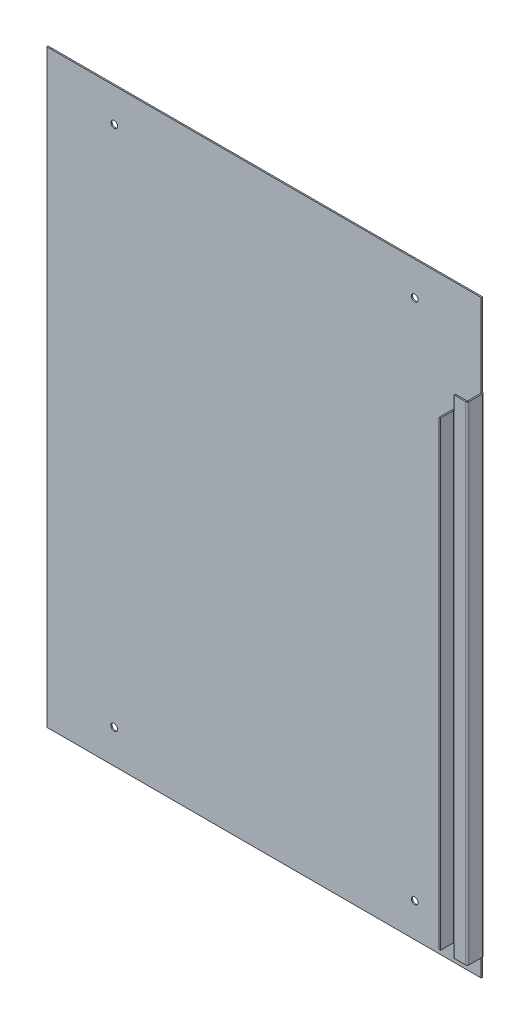
ISO-10303-21;
HEADER;
FILE_DESCRIPTION(('STEP AP214'),'2;1');
FILE_NAME('part.step','',(''),(''),'','','');
FILE_SCHEMA(('AUTOMOTIVE_DESIGN { 1 0 10303 214 1 1 1 1 }'));
ENDSEC;
DATA;
#1=APPLICATION_CONTEXT('core data for automotive mechanical design processes');
#2=APPLICATION_PROTOCOL_DEFINITION('international standard','automotive_design',2000,#1);
#3=PRODUCT_CONTEXT('',#1,'mechanical');
#4=PRODUCT('Part','Part','',(#3));
#5=PRODUCT_RELATED_PRODUCT_CATEGORY('part','',(#4));
#6=PRODUCT_DEFINITION_FORMATION('','',#4);
#7=PRODUCT_DEFINITION_CONTEXT('part definition',#1,'design');
#8=PRODUCT_DEFINITION('design','',#6,#7);
#9=PRODUCT_DEFINITION_SHAPE('','',#8);
#10=(LENGTH_UNIT() NAMED_UNIT(*) SI_UNIT(.MILLI.,.METRE.));
#11=(NAMED_UNIT(*) PLANE_ANGLE_UNIT() SI_UNIT($,.RADIAN.));
#12=(NAMED_UNIT(*) SI_UNIT($,.STERADIAN.) SOLID_ANGLE_UNIT());
#13=UNCERTAINTY_MEASURE_WITH_UNIT(LENGTH_MEASURE(1.E-05),#10,'distance_accuracy_value','');
#14=(GEOMETRIC_REPRESENTATION_CONTEXT(3) GLOBAL_UNCERTAINTY_ASSIGNED_CONTEXT((#13)) GLOBAL_UNIT_ASSIGNED_CONTEXT((#10,
#11,#12)) REPRESENTATION_CONTEXT('',''));
#15=CARTESIAN_POINT('',(0.,0.,0.));
#16=DIRECTION('',(0.,0.,1.));
#17=DIRECTION('',(1.,0.,0.));
#18=AXIS2_PLACEMENT_3D('',#15,#16,#17);
#19=CARTESIAN_POINT('',(302.15,876.2,25.));
#20=DIRECTION('',(1.,0.,0.));
#21=DIRECTION('',(0.,0.,-1.));
#22=AXIS2_PLACEMENT_3D('',#19,#20,#21);
#23=PLANE('',#22);
#24=DIRECTION('',(0.,0.,-1.));
#25=VECTOR('',#24,1.);
#26=CARTESIAN_POINT('',(302.15,733.7,22.3634));
#27=LINE('',#26,#25);
#28=CARTESIAN_POINT('',(302.15,733.7,45.));
#29=VERTEX_POINT('',#28);
#30=CARTESIAN_POINT('',(302.15,733.7,25.7366));
#31=VERTEX_POINT('',#30);
#32=EDGE_CURVE('E225',#29,#31,#27,.T.);
#33=ORIENTED_EDGE('',*,*,#32,.T.);
#34=DIRECTION('',(0.,-1.,0.));
#35=VECTOR('',#34,1.);
#36=CARTESIAN_POINT('',(302.15,876.2,25.7366));
#37=LINE('',#36,#35);
#38=CARTESIAN_POINT('',(302.15,48.4,25.7366));
#39=VERTEX_POINT('',#38);
#40=EDGE_CURVE('E248',#31,#39,#37,.T.);
#41=ORIENTED_EDGE('',*,*,#40,.T.);
#42=DIRECTION('',(0.,0.,1.));
#43=VECTOR('',#42,1.);
#44=CARTESIAN_POINT('',(302.15,48.4,35.3683));
#45=LINE('',#44,#43);
#46=CARTESIAN_POINT('',(302.15,48.4,45.));
#47=VERTEX_POINT('',#46);
#48=EDGE_CURVE('E231',#47,#39,#45,.F.);
#49=ORIENTED_EDGE('',*,*,#48,.F.);
#50=DIRECTION('',(0.,-1.,0.));
#51=VECTOR('',#50,1.);
#52=CARTESIAN_POINT('',(302.15,876.2,45.));
#53=LINE('',#52,#51);
#54=EDGE_CURVE('E250',#29,#47,#53,.T.);
#55=ORIENTED_EDGE('',*,*,#54,.F.);
#56=EDGE_LOOP('',(#33,#41,#49,#55));
#57=FACE_BOUND('',#56,.T.);
#58=ADVANCED_FACE('F69',(#57),#23,.F.);
#59=CARTESIAN_POINT('',(304.05,876.2,45.));
#60=DIRECTION('',(0.,0.,1.));
#61=DIRECTION('',(1.,0.,0.));
#62=AXIS2_PLACEMENT_3D('',#59,#60,#61);
#63=PLANE('',#62);
#64=DIRECTION('',(0.,-1.,0.));
#65=VECTOR('',#64,1.);
#66=CARTESIAN_POINT('',(304.05,876.2,45.));
#67=LINE('',#66,#65);
#68=CARTESIAN_POINT('',(304.05,733.7,45.));
#69=VERTEX_POINT('',#68);
#70=CARTESIAN_POINT('',(304.05,48.4,45.));
#71=VERTEX_POINT('',#70);
#72=EDGE_CURVE('E303',#69,#71,#67,.T.);
#73=ORIENTED_EDGE('',*,*,#72,.F.);
#74=DIRECTION('',(1.,0.,0.));
#75=VECTOR('',#74,1.);
#76=CARTESIAN_POINT('',(302.15,733.7,45.));
#77=LINE('',#76,#75);
#78=EDGE_CURVE('E251',#69,#29,#77,.F.);
#79=ORIENTED_EDGE('',*,*,#78,.T.);
#80=ORIENTED_EDGE('',*,*,#54,.T.);
#81=DIRECTION('',(-1.,0.,0.));
#82=VECTOR('',#81,1.);
#83=CARTESIAN_POINT('',(304.05,48.4,45.));
#84=LINE('',#83,#82);
#85=EDGE_CURVE('E329',#47,#71,#84,.F.);
#86=ORIENTED_EDGE('',*,*,#85,.T.);
#87=EDGE_LOOP('',(#73,#79,#80,#86));
#88=FACE_BOUND('',#87,.T.);
#89=ADVANCED_FACE('F562',(#88),#63,.T.);
#90=CARTESIAN_POINT('',(304.05,876.2,25.));
#91=DIRECTION('',(1.,0.,0.));
#92=DIRECTION('',(0.,0.,-1.));
#93=AXIS2_PLACEMENT_3D('',#90,#91,#92);
#94=PLANE('',#93);
#95=DIRECTION('',(0.,-1.,0.));
#96=VECTOR('',#95,1.);
#97=CARTESIAN_POINT('',(304.05,876.2,25.7366));
#98=LINE('',#97,#96);
#99=CARTESIAN_POINT('',(304.05,733.7,25.7366));
#100=VERTEX_POINT('',#99);
#101=CARTESIAN_POINT('',(304.05,48.4000000000002,25.7366));
#102=VERTEX_POINT('',#101);
#103=EDGE_CURVE('E300',#100,#102,#98,.T.);
#104=ORIENTED_EDGE('',*,*,#103,.F.);
#105=DIRECTION('',(0.,0.,-1.));
#106=VECTOR('',#105,1.);
#107=CARTESIAN_POINT('',(304.05,733.7,35.3683));
#108=LINE('',#107,#106);
#109=EDGE_CURVE('E228',#69,#100,#108,.T.);
#110=ORIENTED_EDGE('',*,*,#109,.F.);
#111=ORIENTED_EDGE('',*,*,#72,.T.);
#112=DIRECTION('',(0.,0.,-1.));
#113=VECTOR('',#112,1.);
#114=CARTESIAN_POINT('',(304.05,48.4,25.));
#115=LINE('',#114,#113);
#116=EDGE_CURVE('E326',#71,#102,#115,.T.);
#117=ORIENTED_EDGE('',*,*,#116,.T.);
#118=EDGE_LOOP('',(#104,#110,#111,#117));
#119=FACE_BOUND('',#118,.T.);
#120=ADVANCED_FACE('F519',(#119),#94,.T.);
#121=CARTESIAN_POINT('',(304.7866,876.2,25.7366));
#122=DIRECTION('',(0.,-1.,0.));
#123=DIRECTION('',(0.,0.,-1.));
#124=AXIS2_PLACEMENT_3D('',#121,#122,#123);
#125=CYLINDRICAL_SURFACE('',#124,0.7366);
#126=CARTESIAN_POINT('',(304.7866,753.7,25.7366));
#127=DIRECTION('',(0.,1.,0.));
#128=DIRECTION('',(0.,0.,1.));
#129=AXIS2_PLACEMENT_3D('',#126,#127,#128);
#130=CIRCLE('',#129,0.736599999999988);
#131=CARTESIAN_POINT('',(304.7866,753.7,25.));
#132=VERTEX_POINT('',#131);
#133=CARTESIAN_POINT('',(304.580812409922,753.7,25.0293298763769));
#134=VERTEX_POINT('',#133);
#135=EDGE_CURVE('E371',#132,#134,#130,.T.);
#136=ORIENTED_EDGE('',*,*,#135,.T.);
#137=DIRECTION('',(0.,-1.,0.));
#138=VECTOR('',#137,1.);
#139=CARTESIAN_POINT('',(304.580812409922,876.2,25.0293298763769));
#140=LINE('',#139,#138);
#141=CARTESIAN_POINT('',(304.580812409922,733.7,25.0293298763769));
#142=VERTEX_POINT('',#141);
#143=EDGE_CURVE('E86',#142,#134,#140,.F.);
#144=ORIENTED_EDGE('',*,*,#143,.F.);
#145=CARTESIAN_POINT('',(304.7866,733.7,25.7366));
#146=DIRECTION('',(0.,-1.,0.));
#147=DIRECTION('',(0.,0.,-1.));
#148=AXIS2_PLACEMENT_3D('',#145,#146,#147);
#149=CIRCLE('',#148,0.7366);
#150=EDGE_CURVE('E334',#142,#100,#149,.F.);
#151=ORIENTED_EDGE('',*,*,#150,.T.);
#152=ORIENTED_EDGE('',*,*,#103,.T.);
#153=CARTESIAN_POINT('',(304.7866,48.4000000000002,25.7366));
#154=DIRECTION('',(0.,-1.,0.));
#155=DIRECTION('',(0.,0.,-1.));
#156=AXIS2_PLACEMENT_3D('',#153,#154,#155);
#157=CIRCLE('',#156,0.7366);
#158=CARTESIAN_POINT('',(304.580812409922,48.4000000000002,25.0293298763769));
#159=VERTEX_POINT('',#158);
#160=EDGE_CURVE('E342',#102,#159,#157,.T.);
#161=ORIENTED_EDGE('',*,*,#160,.T.);
#162=DIRECTION('',(0.,-1.,0.));
#163=VECTOR('',#162,1.);
#164=CARTESIAN_POINT('',(304.580812409922,876.2,25.0293298763769));
#165=LINE('',#164,#163);
#166=CARTESIAN_POINT('',(304.580812409922,28.4000000000002,25.0293298763769));
#167=VERTEX_POINT('',#166);
#168=EDGE_CURVE('E339',#167,#159,#165,.F.);
#169=ORIENTED_EDGE('',*,*,#168,.F.);
#170=CARTESIAN_POINT('',(304.7866,28.4000000000004,25.7366));
#171=DIRECTION('',(0.,-1.,0.));
#172=DIRECTION('',(0.,0.,-1.));
#173=AXIS2_PLACEMENT_3D('',#170,#171,#172);
#174=CIRCLE('',#173,0.7366);
#175=CARTESIAN_POINT('',(304.7866,28.4,25.));
#176=VERTEX_POINT('',#175);
#177=EDGE_CURVE('E421',#176,#167,#174,.F.);
#178=ORIENTED_EDGE('',*,*,#177,.F.);
#179=DIRECTION('',(0.,-1.,0.));
#180=VECTOR('',#179,1.);
#181=CARTESIAN_POINT('',(304.7866,876.2,25.));
#182=LINE('',#181,#180);
#183=EDGE_CURVE('E297',#132,#176,#182,.T.);
#184=ORIENTED_EDGE('',*,*,#183,.F.);
#185=EDGE_LOOP('',(#136,#144,#151,#152,#161,#169,#178,#184));
#186=FACE_BOUND('',#185,.T.);
#187=ADVANCED_FACE('F510',(#186),#125,.F.);
#188=CARTESIAN_POINT('',(304.7866,876.2,25.7366));
#189=DIRECTION('',(0.,-1.,0.));
#190=DIRECTION('',(0.,0.,-1.));
#191=AXIS2_PLACEMENT_3D('',#188,#189,#190);
#192=CYLINDRICAL_SURFACE('',#191,2.6366);
#193=DIRECTION('',(0.,-1.,0.));
#194=VECTOR('',#193,1.);
#195=CARTESIAN_POINT('',(304.05,876.2,23.2049839153616));
#196=LINE('',#195,#194);
#197=CARTESIAN_POINT('',(304.05,733.7,23.2049839153616));
#198=VERTEX_POINT('',#197);
#199=CARTESIAN_POINT('',(304.05,753.7,23.2049839153616));
#200=VERTEX_POINT('',#199);
#201=EDGE_CURVE('E242',#198,#200,#196,.F.);
#202=ORIENTED_EDGE('',*,*,#201,.T.);
#203=CARTESIAN_POINT('',(304.7866,753.7,25.7366));
#204=DIRECTION('',(0.,-1.,0.));
#205=DIRECTION('',(0.,0.,-1.));
#206=AXIS2_PLACEMENT_3D('',#203,#204,#205);
#207=CIRCLE('',#206,2.6366);
#208=CARTESIAN_POINT('',(304.7866,753.7,23.1));
#209=VERTEX_POINT('',#208);
#210=EDGE_CURVE('E382',#209,#200,#207,.F.);
#211=ORIENTED_EDGE('',*,*,#210,.F.);
#212=DIRECTION('',(0.,-1.,0.));
#213=VECTOR('',#212,1.);
#214=CARTESIAN_POINT('',(304.7866,876.2,23.1));
#215=LINE('',#214,#213);
#216=CARTESIAN_POINT('',(304.7866,28.4,23.1));
#217=VERTEX_POINT('',#216);
#218=EDGE_CURVE('E256',#209,#217,#215,.T.);
#219=ORIENTED_EDGE('',*,*,#218,.T.);
#220=CARTESIAN_POINT('',(304.7866,28.4,25.7366));
#221=DIRECTION('',(0.,1.,0.));
#222=DIRECTION('',(0.,0.,1.));
#223=AXIS2_PLACEMENT_3D('',#220,#221,#222);
#224=CIRCLE('',#223,2.6366);
#225=CARTESIAN_POINT('',(304.05,28.4,23.2049839153616));
#226=VERTEX_POINT('',#225);
#227=EDGE_CURVE('E401',#217,#226,#224,.T.);
#228=ORIENTED_EDGE('',*,*,#227,.T.);
#229=DIRECTION('',(0.,-1.,0.));
#230=VECTOR('',#229,1.);
#231=CARTESIAN_POINT('',(304.05,876.2,23.2049839153616));
#232=LINE('',#231,#230);
#233=CARTESIAN_POINT('',(304.05,48.4,23.2049839153616));
#234=VERTEX_POINT('',#233);
#235=EDGE_CURVE('E94',#226,#234,#232,.F.);
#236=ORIENTED_EDGE('',*,*,#235,.T.);
#237=CARTESIAN_POINT('',(304.7866,48.4,25.7366));
#238=DIRECTION('',(0.,-1.,0.));
#239=DIRECTION('',(0.,0.,-1.));
#240=AXIS2_PLACEMENT_3D('',#237,#238,#239);
#241=CIRCLE('',#240,2.6366);
#242=EDGE_CURVE('E255',#39,#234,#241,.T.);
#243=ORIENTED_EDGE('',*,*,#242,.F.);
#244=ORIENTED_EDGE('',*,*,#40,.F.);
#245=CARTESIAN_POINT('',(304.7866,733.7,25.7366));
#246=DIRECTION('',(0.,1.,0.));
#247=DIRECTION('',(0.,0.,1.));
#248=AXIS2_PLACEMENT_3D('',#245,#246,#247);
#249=CIRCLE('',#248,2.6366);
#250=EDGE_CURVE('E236',#198,#31,#249,.T.);
#251=ORIENTED_EDGE('',*,*,#250,.F.);
#252=EDGE_LOOP('',(#202,#211,#219,#228,#236,#243,#244,#251));
#253=FACE_BOUND('',#252,.T.);
#254=ADVANCED_FACE('F254',(#253),#192,.T.);
#255=CARTESIAN_POINT('',(304.7866,753.7,25.7366));
#256=DIRECTION('',(0.,-1.,0.));
#257=DIRECTION('',(0.,0.,-1.));
#258=AXIS2_PLACEMENT_3D('',#255,#256,#257);
#259=PLANE('',#258);
#260=ORIENTED_EDGE('',*,*,#210,.T.);
#261=DIRECTION('',(-0.279374952590448,0.,-0.960182084744912));
#262=VECTOR('',#261,1.);
#263=CARTESIAN_POINT('',(304.05,753.7,23.2049839153616));
#264=LINE('',#263,#262);
#265=EDGE_CURVE('E232',#200,#134,#264,.F.);
#266=ORIENTED_EDGE('',*,*,#265,.T.);
#267=ORIENTED_EDGE('',*,*,#135,.F.);
#268=DIRECTION('',(0.,0.,-1.));
#269=VECTOR('',#268,1.);
#270=CARTESIAN_POINT('',(304.7866,753.7,25.));
#271=LINE('',#270,#269);
#272=EDGE_CURVE('E358',#132,#209,#271,.T.);
#273=ORIENTED_EDGE('',*,*,#272,.T.);
#274=EDGE_LOOP('',(#260,#266,#267,#273));
#275=FACE_BOUND('',#274,.T.);
#276=ADVANCED_FACE('F525',(#275),#259,.F.);
#277=CARTESIAN_POINT('',(304.7866,28.4,25.7366));
#278=DIRECTION('',(0.,-1.,0.));
#279=DIRECTION('',(0.,0.,-1.));
#280=AXIS2_PLACEMENT_3D('',#277,#278,#279);
#281=PLANE('',#280);
#282=ORIENTED_EDGE('',*,*,#177,.T.);
#283=DIRECTION('',(-0.279374952590448,0.,-0.960182084744912));
#284=VECTOR('',#283,1.);
#285=CARTESIAN_POINT('',(304.05,28.4,23.2049839153616));
#286=LINE('',#285,#284);
#287=EDGE_CURVE('E347',#226,#167,#286,.F.);
#288=ORIENTED_EDGE('',*,*,#287,.F.);
#289=ORIENTED_EDGE('',*,*,#227,.F.);
#290=DIRECTION('',(0.,0.,-1.));
#291=VECTOR('',#290,1.);
#292=CARTESIAN_POINT('',(304.7866,28.4000000000002,23.1));
#293=LINE('',#292,#291);
#294=EDGE_CURVE('E412',#217,#176,#293,.F.);
#295=ORIENTED_EDGE('',*,*,#294,.T.);
#296=EDGE_LOOP('',(#282,#288,#289,#295));
#297=FACE_BOUND('',#296,.T.);
#298=ADVANCED_FACE('F507',(#297),#281,.T.);
#299=CARTESIAN_POINT('',(324.05,876.2,25.));
#300=DIRECTION('',(0.,0.,1.));
#301=DIRECTION('',(1.,0.,0.));
#302=AXIS2_PLACEMENT_3D('',#299,#300,#301);
#303=PLANE('',#302);
#304=DIRECTION('',(0.,-1.,0.));
#305=VECTOR('',#304,1.);
#306=CARTESIAN_POINT('',(321.4134,876.2,25.));
#307=LINE('',#306,#305);
#308=CARTESIAN_POINT('',(321.4134,753.7,25.));
#309=VERTEX_POINT('',#308);
#310=CARTESIAN_POINT('',(321.4134,28.4000000000004,25.));
#311=VERTEX_POINT('',#310);
#312=EDGE_CURVE('E294',#309,#311,#307,.T.);
#313=ORIENTED_EDGE('',*,*,#312,.F.);
#314=DIRECTION('',(1.,0.,0.));
#315=VECTOR('',#314,1.);
#316=CARTESIAN_POINT('',(313.1,753.7,25.));
#317=LINE('',#316,#315);
#318=EDGE_CURVE('E352',#132,#309,#317,.T.);
#319=ORIENTED_EDGE('',*,*,#318,.F.);
#320=ORIENTED_EDGE('',*,*,#183,.T.);
#321=DIRECTION('',(1.,0.,0.));
#322=VECTOR('',#321,1.);
#323=CARTESIAN_POINT('',(324.05,28.4,25.));
#324=LINE('',#323,#322);
#325=EDGE_CURVE('E404',#176,#311,#324,.T.);
#326=ORIENTED_EDGE('',*,*,#325,.T.);
#327=EDGE_LOOP('',(#313,#319,#320,#326));
#328=FACE_BOUND('',#327,.T.);
#329=ADVANCED_FACE('F499',(#328),#303,.T.);
#330=CARTESIAN_POINT('',(321.4134,876.2,22.3634));
#331=DIRECTION('',(0.,-1.,0.));
#332=DIRECTION('',(0.,0.,-1.));
#333=AXIS2_PLACEMENT_3D('',#330,#331,#332);
#334=CYLINDRICAL_SURFACE('',#333,2.6366);
#335=DIRECTION('',(0.,-1.,0.));
#336=VECTOR('',#335,1.);
#337=CARTESIAN_POINT('',(324.05,876.2,22.3634));
#338=LINE('',#337,#336);
#339=CARTESIAN_POINT('',(324.05,753.7,22.3634));
#340=VERTEX_POINT('',#339);
#341=CARTESIAN_POINT('',(324.05,28.4000000000004,22.3634));
#342=VERTEX_POINT('',#341);
#343=EDGE_CURVE('E291',#340,#342,#338,.T.);
#344=ORIENTED_EDGE('',*,*,#343,.F.);
#345=CARTESIAN_POINT('',(321.4134,753.7,22.3634));
#346=DIRECTION('',(0.,-1.,0.));
#347=DIRECTION('',(0.,0.,-1.));
#348=AXIS2_PLACEMENT_3D('',#345,#346,#347);
#349=CIRCLE('',#348,2.63659999999999);
#350=EDGE_CURVE('E376',#340,#309,#349,.T.);
#351=ORIENTED_EDGE('',*,*,#350,.T.);
#352=ORIENTED_EDGE('',*,*,#312,.T.);
#353=CARTESIAN_POINT('',(321.4134,28.4000000000002,22.3634));
#354=DIRECTION('',(0.,1.,0.));
#355=DIRECTION('',(0.,0.,1.));
#356=AXIS2_PLACEMENT_3D('',#353,#354,#355);
#357=CIRCLE('',#356,2.63659999999999);
#358=EDGE_CURVE('E417',#311,#342,#357,.T.);
#359=ORIENTED_EDGE('',*,*,#358,.T.);
#360=EDGE_LOOP('',(#344,#351,#352,#359));
#361=FACE_BOUND('',#360,.T.);
#362=ADVANCED_FACE('F494',(#361),#334,.T.);
#363=CARTESIAN_POINT('',(324.05,876.2,0.));
#364=DIRECTION('',(1.,0.,0.));
#365=DIRECTION('',(0.,0.,-1.));
#366=AXIS2_PLACEMENT_3D('',#363,#364,#365);
#367=PLANE('',#366);
#368=DIRECTION('',(0.,-1.,0.));
#369=VECTOR('',#368,1.);
#370=CARTESIAN_POINT('',(324.05,876.2,2.6366));
#371=LINE('',#370,#369);
#372=CARTESIAN_POINT('',(324.05,753.7,2.6366));
#373=VERTEX_POINT('',#372);
#374=CARTESIAN_POINT('',(324.05,28.4,2.6366));
#375=VERTEX_POINT('',#374);
#376=EDGE_CURVE('E288',#373,#375,#371,.T.);
#377=ORIENTED_EDGE('',*,*,#376,.F.);
#378=DIRECTION('',(0.,0.,-1.));
#379=VECTOR('',#378,1.);
#380=CARTESIAN_POINT('',(324.05,753.7,12.5));
#381=LINE('',#380,#379);
#382=EDGE_CURVE('E359',#340,#373,#381,.T.);
#383=ORIENTED_EDGE('',*,*,#382,.F.);
#384=ORIENTED_EDGE('',*,*,#343,.T.);
#385=DIRECTION('',(0.,0.,-1.));
#386=VECTOR('',#385,1.);
#387=CARTESIAN_POINT('',(324.05,28.4,-1.02280914679379E-13));
#388=LINE('',#387,#386);
#389=EDGE_CURVE('E398',#342,#375,#388,.T.);
#390=ORIENTED_EDGE('',*,*,#389,.T.);
#391=EDGE_LOOP('',(#377,#383,#384,#390));
#392=FACE_BOUND('',#391,.T.);
#393=ADVANCED_FACE('F483',(#392),#367,.T.);
#394=CARTESIAN_POINT('',(321.4134,876.2,2.6366));
#395=DIRECTION('',(0.,-1.,0.));
#396=DIRECTION('',(0.,0.,-1.));
#397=AXIS2_PLACEMENT_3D('',#394,#395,#396);
#398=CYLINDRICAL_SURFACE('',#397,2.6366);
#399=DIRECTION('',(0.,-1.,0.));
#400=VECTOR('',#399,1.);
#401=CARTESIAN_POINT('',(321.4134,876.2,0.));
#402=LINE('',#401,#400);
#403=CARTESIAN_POINT('',(321.4134,753.7,0.));
#404=VERTEX_POINT('',#403);
#405=CARTESIAN_POINT('',(321.4134,28.4000000000006,0.));
#406=VERTEX_POINT('',#405);
#407=EDGE_CURVE('E284',#404,#406,#402,.T.);
#408=ORIENTED_EDGE('',*,*,#407,.F.);
#409=CARTESIAN_POINT('',(321.4134,753.7,2.6366));
#410=DIRECTION('',(0.,-1.,0.));
#411=DIRECTION('',(0.,0.,-1.));
#412=AXIS2_PLACEMENT_3D('',#409,#410,#411);
#413=CIRCLE('',#412,2.63659999999999);
#414=EDGE_CURVE('E394',#404,#373,#413,.T.);
#415=ORIENTED_EDGE('',*,*,#414,.T.);
#416=ORIENTED_EDGE('',*,*,#376,.T.);
#417=CARTESIAN_POINT('',(321.4134,28.4,2.6366));
#418=DIRECTION('',(0.,1.,0.));
#419=DIRECTION('',(0.,0.,1.));
#420=AXIS2_PLACEMENT_3D('',#417,#418,#419);
#421=CIRCLE('',#420,2.63659999999999);
#422=EDGE_CURVE('E440',#375,#406,#421,.T.);
#423=ORIENTED_EDGE('',*,*,#422,.T.);
#424=EDGE_LOOP('',(#408,#415,#416,#423));
#425=FACE_BOUND('',#424,.T.);
#426=ADVANCED_FACE('F479',(#425),#398,.T.);
#427=CARTESIAN_POINT('',(321.4134,876.2,2.6366));
#428=DIRECTION('',(0.,-1.,0.));
#429=DIRECTION('',(0.,0.,-1.));
#430=AXIS2_PLACEMENT_3D('',#427,#428,#429);
#431=CYLINDRICAL_SURFACE('',#430,0.7366);
#432=CARTESIAN_POINT('',(321.4134,753.7,2.6366));
#433=DIRECTION('',(0.,-1.,0.));
#434=DIRECTION('',(0.,0.,-1.));
#435=AXIS2_PLACEMENT_3D('',#432,#433,#434);
#436=CIRCLE('',#435,0.7366);
#437=CARTESIAN_POINT('',(321.4134,753.7,1.9));
#438=VERTEX_POINT('',#437);
#439=CARTESIAN_POINT('',(322.15,753.7,2.6366));
#440=VERTEX_POINT('',#439);
#441=EDGE_CURVE('E392',#438,#440,#436,.T.);
#442=ORIENTED_EDGE('',*,*,#441,.F.);
#443=DIRECTION('',(0.,-1.,0.));
#444=VECTOR('',#443,1.);
#445=CARTESIAN_POINT('',(321.4134,876.2,1.9));
#446=LINE('',#445,#444);
#447=CARTESIAN_POINT('',(321.4134,28.4000000000006,1.9));
#448=VERTEX_POINT('',#447);
#449=EDGE_CURVE('E277',#438,#448,#446,.T.);
#450=ORIENTED_EDGE('',*,*,#449,.T.);
#451=CARTESIAN_POINT('',(321.4134,28.4,2.6366));
#452=DIRECTION('',(0.,-1.,0.));
#453=DIRECTION('',(0.,0.,-1.));
#454=AXIS2_PLACEMENT_3D('',#451,#452,#453);
#455=CIRCLE('',#454,0.7366);
#456=CARTESIAN_POINT('',(322.15,28.4,2.6366));
#457=VERTEX_POINT('',#456);
#458=EDGE_CURVE('E438',#457,#448,#455,.F.);
#459=ORIENTED_EDGE('',*,*,#458,.F.);
#460=DIRECTION('',(0.,-1.,0.));
#461=VECTOR('',#460,1.);
#462=CARTESIAN_POINT('',(322.15,876.2,2.6366));
#463=LINE('',#462,#461);
#464=EDGE_CURVE('E274',#440,#457,#463,.T.);
#465=ORIENTED_EDGE('',*,*,#464,.F.);
#466=EDGE_LOOP('',(#442,#450,#459,#465));
#467=FACE_BOUND('',#466,.T.);
#468=ADVANCED_FACE('F541',(#467),#431,.F.);
#469=CARTESIAN_POINT('',(322.15,876.2,0.));
#470=DIRECTION('',(1.,0.,0.));
#471=DIRECTION('',(0.,0.,-1.));
#472=AXIS2_PLACEMENT_3D('',#469,#470,#471);
#473=PLANE('',#472);
#474=DIRECTION('',(0.,0.,-1.));
#475=VECTOR('',#474,1.);
#476=CARTESIAN_POINT('',(322.15,753.7,1.9));
#477=LINE('',#476,#475);
#478=CARTESIAN_POINT('',(322.15,753.7,22.3634));
#479=VERTEX_POINT('',#478);
#480=EDGE_CURVE('E355',#479,#440,#477,.T.);
#481=ORIENTED_EDGE('',*,*,#480,.T.);
#482=ORIENTED_EDGE('',*,*,#464,.T.);
#483=DIRECTION('',(0.,0.,1.));
#484=VECTOR('',#483,1.);
#485=CARTESIAN_POINT('',(322.15,28.4,12.5));
#486=LINE('',#485,#484);
#487=CARTESIAN_POINT('',(322.15,28.4000000000004,22.3634));
#488=VERTEX_POINT('',#487);
#489=EDGE_CURVE('E402',#488,#457,#486,.F.);
#490=ORIENTED_EDGE('',*,*,#489,.F.);
#491=DIRECTION('',(0.,-1.,0.));
#492=VECTOR('',#491,1.);
#493=CARTESIAN_POINT('',(322.15,876.2,22.3634));
#494=LINE('',#493,#492);
#495=EDGE_CURVE('E271',#479,#488,#494,.T.);
#496=ORIENTED_EDGE('',*,*,#495,.F.);
#497=EDGE_LOOP('',(#481,#482,#490,#496));
#498=FACE_BOUND('',#497,.T.);
#499=ADVANCED_FACE('F537',(#498),#473,.F.);
#500=CARTESIAN_POINT('',(321.4134,876.2,22.3634));
#501=DIRECTION('',(0.,-1.,0.));
#502=DIRECTION('',(0.,0.,-1.));
#503=AXIS2_PLACEMENT_3D('',#500,#501,#502);
#504=CYLINDRICAL_SURFACE('',#503,0.7366);
#505=CARTESIAN_POINT('',(321.4134,753.7,22.3634));
#506=DIRECTION('',(0.,-1.,0.));
#507=DIRECTION('',(0.,0.,-1.));
#508=AXIS2_PLACEMENT_3D('',#505,#506,#507);
#509=CIRCLE('',#508,0.7366);
#510=CARTESIAN_POINT('',(321.4134,753.7,23.1));
#511=VERTEX_POINT('',#510);
#512=EDGE_CURVE('E374',#479,#511,#509,.T.);
#513=ORIENTED_EDGE('',*,*,#512,.F.);
#514=ORIENTED_EDGE('',*,*,#495,.T.);
#515=CARTESIAN_POINT('',(321.4134,28.4000000000002,22.3634));
#516=DIRECTION('',(0.,-1.,0.));
#517=DIRECTION('',(0.,0.,-1.));
#518=AXIS2_PLACEMENT_3D('',#515,#516,#517);
#519=CIRCLE('',#518,0.7366);
#520=CARTESIAN_POINT('',(321.4134,28.4000000000004,23.1));
#521=VERTEX_POINT('',#520);
#522=EDGE_CURVE('E415',#521,#488,#519,.F.);
#523=ORIENTED_EDGE('',*,*,#522,.F.);
#524=DIRECTION('',(0.,-1.,0.));
#525=VECTOR('',#524,1.);
#526=CARTESIAN_POINT('',(321.4134,876.2,23.1));
#527=LINE('',#526,#525);
#528=EDGE_CURVE('E260',#511,#521,#527,.T.);
#529=ORIENTED_EDGE('',*,*,#528,.F.);
#530=EDGE_LOOP('',(#513,#514,#523,#529));
#531=FACE_BOUND('',#530,.T.);
#532=ADVANCED_FACE('F534',(#531),#504,.F.);
#533=CARTESIAN_POINT('',(324.05,876.2,23.1));
#534=DIRECTION('',(0.,0.,1.));
#535=DIRECTION('',(1.,0.,0.));
#536=AXIS2_PLACEMENT_3D('',#533,#534,#535);
#537=PLANE('',#536);
#538=DIRECTION('',(1.,0.,0.));
#539=VECTOR('',#538,1.);
#540=CARTESIAN_POINT('',(324.05,753.7,23.1));
#541=LINE('',#540,#539);
#542=EDGE_CURVE('E362',#209,#511,#541,.T.);
#543=ORIENTED_EDGE('',*,*,#542,.T.);
#544=ORIENTED_EDGE('',*,*,#528,.T.);
#545=DIRECTION('',(-1.,0.,0.));
#546=VECTOR('',#545,1.);
#547=CARTESIAN_POINT('',(313.1,28.4,23.1));
#548=LINE('',#547,#546);
#549=EDGE_CURVE('E397',#217,#521,#548,.F.);
#550=ORIENTED_EDGE('',*,*,#549,.F.);
#551=ORIENTED_EDGE('',*,*,#218,.F.);
#552=EDGE_LOOP('',(#543,#544,#550,#551));
#553=FACE_BOUND('',#552,.T.);
#554=ADVANCED_FACE('F531',(#553),#537,.F.);
#555=CARTESIAN_POINT('',(322.15,0.,2.6366));
#556=DIRECTION('',(0.,-1.,0.));
#557=DIRECTION('',(0.,0.,-1.));
#558=AXIS2_PLACEMENT_3D('',#555,#556,#557);
#559=PLANE('',#558);
#560=DIRECTION('',(1.,0.,0.));
#561=VECTOR('',#560,1.);
#562=CARTESIAN_POINT('',(-324.05,0.,0.));
#563=LINE('',#562,#561);
#564=CARTESIAN_POINT('',(-324.05,0.,0.));
#565=VERTEX_POINT('',#564);
#566=CARTESIAN_POINT('',(321.4134,0.,0.));
#567=VERTEX_POINT('',#566);
#568=EDGE_CURVE('E443',#565,#567,#563,.T.);
#569=ORIENTED_EDGE('',*,*,#568,.T.);
#570=DIRECTION('',(0.,0.,1.));
#571=VECTOR('',#570,1.);
#572=CARTESIAN_POINT('',(321.4134,0.,0.));
#573=LINE('',#572,#571);
#574=CARTESIAN_POINT('',(321.4134,0.,1.9));
#575=VERTEX_POINT('',#574);
#576=EDGE_CURVE('E78',#567,#575,#573,.T.);
#577=ORIENTED_EDGE('',*,*,#576,.T.);
#578=DIRECTION('',(1.,0.,0.));
#579=VECTOR('',#578,1.);
#580=CARTESIAN_POINT('',(-324.05,0.,1.9));
#581=LINE('',#580,#579);
#582=CARTESIAN_POINT('',(-324.05,0.,1.9));
#583=VERTEX_POINT('',#582);
#584=EDGE_CURVE('E266',#583,#575,#581,.T.);
#585=ORIENTED_EDGE('',*,*,#584,.F.);
#586=DIRECTION('',(0.,0.,-1.));
#587=VECTOR('',#586,1.);
#588=CARTESIAN_POINT('',(-324.05,0.,1.9));
#589=LINE('',#588,#587);
#590=EDGE_CURVE('E450',#583,#565,#589,.T.);
#591=ORIENTED_EDGE('',*,*,#590,.T.);
#592=EDGE_LOOP('',(#569,#577,#585,#591));
#593=FACE_BOUND('',#592,.T.);
#594=ADVANCED_FACE('F71',(#593),#559,.T.);
#595=CARTESIAN_POINT('',(-324.05,876.2,0.));
#596=DIRECTION('',(0.,0.,-1.));
#597=DIRECTION('',(-1.,0.,0.));
#598=AXIS2_PLACEMENT_3D('',#595,#596,#597);
#599=PLANE('',#598);
#600=CARTESIAN_POINT('',(-224.05,50.,0.));
#601=DIRECTION('',(0.,0.,1.));
#602=DIRECTION('',(-1.,0.,0.));
#603=AXIS2_PLACEMENT_3D('',#600,#601,#602);
#604=CIRCLE('',#603,4.99999999999999);
#605=CARTESIAN_POINT('',(-229.05,50.,0.));
#606=VERTEX_POINT('',#605);
#607=EDGE_CURVE('E1115',#606,#606,#604,.T.);
#608=ORIENTED_EDGE('',*,*,#607,.T.);
#609=EDGE_LOOP('',(#608));
#610=FACE_BOUND('',#609,.T.);
#611=CARTESIAN_POINT('',(222.7317,50.,0.));
#612=DIRECTION('',(0.,0.,1.));
#613=DIRECTION('',(-1.,0.,0.));
#614=AXIS2_PLACEMENT_3D('',#611,#612,#613);
#615=CIRCLE('',#614,5.00000000000002);
#616=CARTESIAN_POINT('',(217.7317,50.,0.));
#617=VERTEX_POINT('',#616);
#618=EDGE_CURVE('E1116',#617,#617,#615,.T.);
#619=ORIENTED_EDGE('',*,*,#618,.T.);
#620=EDGE_LOOP('',(#619));
#621=FACE_BOUND('',#620,.T.);
#622=CARTESIAN_POINT('',(222.7317,826.2,0.));
#623=DIRECTION('',(0.,0.,1.));
#624=DIRECTION('',(1.,0.,0.));
#625=AXIS2_PLACEMENT_3D('',#622,#623,#624);
#626=CIRCLE('',#625,5.00000000000002);
#627=CARTESIAN_POINT('',(227.7317,826.2,0.));
#628=VERTEX_POINT('',#627);
#629=EDGE_CURVE('E1119',#628,#628,#626,.T.);
#630=ORIENTED_EDGE('',*,*,#629,.T.);
#631=EDGE_LOOP('',(#630));
#632=FACE_BOUND('',#631,.T.);
#633=CARTESIAN_POINT('',(-224.05,826.2,0.));
#634=DIRECTION('',(0.,0.,1.));
#635=DIRECTION('',(1.,0.,0.));
#636=AXIS2_PLACEMENT_3D('',#633,#634,#635);
#637=CIRCLE('',#636,4.99999999999999);
#638=CARTESIAN_POINT('',(-219.05,826.2,0.));
#639=VERTEX_POINT('',#638);
#640=EDGE_CURVE('E313',#639,#639,#637,.T.);
#641=ORIENTED_EDGE('',*,*,#640,.T.);
#642=EDGE_LOOP('',(#641));
#643=FACE_BOUND('',#642,.T.);
#644=ORIENTED_EDGE('',*,*,#568,.F.);
#645=DIRECTION('',(0.,-1.,0.));
#646=VECTOR('',#645,1.);
#647=CARTESIAN_POINT('',(-324.05,876.2,0.));
#648=LINE('',#647,#646);
#649=CARTESIAN_POINT('',(-324.05,876.2,0.));
#650=VERTEX_POINT('',#649);
#651=EDGE_CURVE('E282',#650,#565,#648,.T.);
#652=ORIENTED_EDGE('',*,*,#651,.F.);
#653=DIRECTION('',(1.,0.,0.));
#654=VECTOR('',#653,1.);
#655=CARTESIAN_POINT('',(-324.05,876.2,0.));
#656=LINE('',#655,#654);
#657=CARTESIAN_POINT('',(321.4134,876.2,0.));
#658=VERTEX_POINT('',#657);
#659=EDGE_CURVE('E444',#650,#658,#656,.T.);
#660=ORIENTED_EDGE('',*,*,#659,.T.);
#661=EDGE_CURVE('E285',#658,#404,#402,.T.);
#662=ORIENTED_EDGE('',*,*,#661,.T.);
#663=ORIENTED_EDGE('',*,*,#407,.T.);
#664=DIRECTION('',(0.,-1.,0.));
#665=VECTOR('',#664,1.);
#666=CARTESIAN_POINT('',(321.4134,876.2,0.));
#667=LINE('',#666,#665);
#668=EDGE_CURVE('E432',#406,#567,#667,.T.);
#669=ORIENTED_EDGE('',*,*,#668,.T.);
#670=EDGE_LOOP('',(#644,#652,#660,#662,#663,#669));
#671=FACE_BOUND('',#670,.T.);
#672=ADVANCED_FACE('F468',(#610,#621,#632,#643,#671),#599,.T.);
#673=CARTESIAN_POINT('',(-324.05,876.2,1.9));
#674=DIRECTION('',(-1.,0.,0.));
#675=DIRECTION('',(0.,0.,1.));
#676=AXIS2_PLACEMENT_3D('',#673,#674,#675);
#677=PLANE('',#676);
#678=ORIENTED_EDGE('',*,*,#590,.F.);
#679=DIRECTION('',(0.,-1.,0.));
#680=VECTOR('',#679,1.);
#681=CARTESIAN_POINT('',(-324.05,876.2,1.9));
#682=LINE('',#681,#680);
#683=CARTESIAN_POINT('',(-324.05,876.2,1.9));
#684=VERTEX_POINT('',#683);
#685=EDGE_CURVE('E280',#684,#583,#682,.T.);
#686=ORIENTED_EDGE('',*,*,#685,.F.);
#687=DIRECTION('',(0.,0.,-1.));
#688=VECTOR('',#687,1.);
#689=CARTESIAN_POINT('',(-324.05,876.2,1.9));
#690=LINE('',#689,#688);
#691=EDGE_CURVE('E263',#684,#650,#690,.T.);
#692=ORIENTED_EDGE('',*,*,#691,.T.);
#693=ORIENTED_EDGE('',*,*,#651,.T.);
#694=EDGE_LOOP('',(#678,#686,#692,#693));
#695=FACE_BOUND('',#694,.T.);
#696=ADVANCED_FACE('F463',(#695),#677,.T.);
#697=CARTESIAN_POINT('',(-324.05,876.2,1.9));
#698=DIRECTION('',(0.,0.,-1.));
#699=DIRECTION('',(-1.,0.,0.));
#700=AXIS2_PLACEMENT_3D('',#697,#698,#699);
#701=PLANE('',#700);
#702=CARTESIAN_POINT('',(-224.05,50.,1.9));
#703=DIRECTION('',(0.,0.,-1.));
#704=DIRECTION('',(-1.,0.,0.));
#705=AXIS2_PLACEMENT_3D('',#702,#703,#704);
#706=CIRCLE('',#705,4.99999999999999);
#707=CARTESIAN_POINT('',(-229.05,50.,1.9));
#708=VERTEX_POINT('',#707);
#709=EDGE_CURVE('E73',#708,#708,#706,.T.);
#710=ORIENTED_EDGE('',*,*,#709,.T.);
#711=EDGE_LOOP('',(#710));
#712=FACE_BOUND('',#711,.T.);
#713=CARTESIAN_POINT('',(222.7317,50.,1.9));
#714=DIRECTION('',(0.,0.,-1.));
#715=DIRECTION('',(-1.,0.,0.));
#716=AXIS2_PLACEMENT_3D('',#713,#714,#715);
#717=CIRCLE('',#716,5.00000000000002);
#718=CARTESIAN_POINT('',(217.7317,50.,1.9));
#719=VERTEX_POINT('',#718);
#720=EDGE_CURVE('E315',#719,#719,#717,.T.);
#721=ORIENTED_EDGE('',*,*,#720,.T.);
#722=EDGE_LOOP('',(#721));
#723=FACE_BOUND('',#722,.T.);
#724=CARTESIAN_POINT('',(222.7317,826.2,1.9));
#725=DIRECTION('',(0.,0.,-1.));
#726=DIRECTION('',(-1.,0.,0.));
#727=AXIS2_PLACEMENT_3D('',#724,#725,#726);
#728=CIRCLE('',#727,5.00000000000002);
#729=CARTESIAN_POINT('',(217.7317,826.2,1.9));
#730=VERTEX_POINT('',#729);
#731=EDGE_CURVE('E312',#730,#730,#728,.T.);
#732=ORIENTED_EDGE('',*,*,#731,.T.);
#733=EDGE_LOOP('',(#732));
#734=FACE_BOUND('',#733,.T.);
#735=CARTESIAN_POINT('',(-224.05,826.2,1.9));
#736=DIRECTION('',(0.,0.,-1.));
#737=DIRECTION('',(-1.,0.,0.));
#738=AXIS2_PLACEMENT_3D('',#735,#736,#737);
#739=CIRCLE('',#738,4.99999999999999);
#740=CARTESIAN_POINT('',(-229.05,826.2,1.9));
#741=VERTEX_POINT('',#740);
#742=EDGE_CURVE('E309',#741,#741,#739,.T.);
#743=ORIENTED_EDGE('',*,*,#742,.T.);
#744=EDGE_LOOP('',(#743));
#745=FACE_BOUND('',#744,.T.);
#746=ORIENTED_EDGE('',*,*,#584,.T.);
#747=DIRECTION('',(0.,-1.,0.));
#748=VECTOR('',#747,1.);
#749=CARTESIAN_POINT('',(321.4134,876.2,1.9));
#750=LINE('',#749,#748);
#751=EDGE_CURVE('E430',#448,#575,#750,.T.);
#752=ORIENTED_EDGE('',*,*,#751,.F.);
#753=ORIENTED_EDGE('',*,*,#449,.F.);
#754=CARTESIAN_POINT('',(321.4134,876.2,1.9));
#755=VERTEX_POINT('',#754);
#756=EDGE_CURVE('E278',#755,#438,#446,.T.);
#757=ORIENTED_EDGE('',*,*,#756,.F.);
#758=DIRECTION('',(1.,0.,0.));
#759=VECTOR('',#758,1.);
#760=CARTESIAN_POINT('',(-324.05,876.2,1.9));
#761=LINE('',#760,#759);
#762=EDGE_CURVE('E257',#684,#755,#761,.T.);
#763=ORIENTED_EDGE('',*,*,#762,.F.);
#764=ORIENTED_EDGE('',*,*,#685,.T.);
#765=EDGE_LOOP('',(#746,#752,#753,#757,#763,#764));
#766=FACE_BOUND('',#765,.T.);
#767=ADVANCED_FACE('F458',(#712,#723,#734,#745,#766),#701,.F.);
#768=CARTESIAN_POINT('',(304.7866,876.2,25.7366));
#769=DIRECTION('',(0.,-1.,0.));
#770=DIRECTION('',(-1.,0.,0.));
#771=AXIS2_PLACEMENT_3D('',#768,#769,#770);
#772=PLANE('',#771);
#773=ORIENTED_EDGE('',*,*,#762,.T.);
#774=DIRECTION('',(0.,0.,-1.));
#775=VECTOR('',#774,1.);
#776=CARTESIAN_POINT('',(321.4134,876.2,1.9));
#777=LINE('',#776,#775);
#778=EDGE_CURVE('E12',#755,#658,#777,.T.);
#779=ORIENTED_EDGE('',*,*,#778,.T.);
#780=ORIENTED_EDGE('',*,*,#659,.F.);
#781=ORIENTED_EDGE('',*,*,#691,.F.);
#782=EDGE_LOOP('',(#773,#779,#780,#781));
#783=FACE_BOUND('',#782,.T.);
#784=ADVANCED_FACE('F588',(#783),#772,.F.);
#785=CARTESIAN_POINT('',(321.4134,753.7,2.6366));
#786=DIRECTION('',(0.,1.,0.));
#787=DIRECTION('',(0.,0.,1.));
#788=AXIS2_PLACEMENT_3D('',#785,#786,#787);
#789=PLANE('',#788);
#790=DIRECTION('',(0.,0.,-1.));
#791=VECTOR('',#790,1.);
#792=CARTESIAN_POINT('',(321.4134,753.7,1.9));
#793=LINE('',#792,#791);
#794=EDGE_CURVE('E389',#438,#404,#793,.T.);
#795=ORIENTED_EDGE('',*,*,#794,.F.);
#796=ORIENTED_EDGE('',*,*,#441,.T.);
#797=DIRECTION('',(-1.,0.,0.));
#798=VECTOR('',#797,1.);
#799=CARTESIAN_POINT('',(324.05,753.7,2.63659999999999));
#800=LINE('',#799,#798);
#801=EDGE_CURVE('E379',#373,#440,#800,.T.);
#802=ORIENTED_EDGE('',*,*,#801,.F.);
#803=ORIENTED_EDGE('',*,*,#414,.F.);
#804=EDGE_LOOP('',(#795,#796,#802,#803));
#805=FACE_BOUND('',#804,.T.);
#806=ADVANCED_FACE('F547',(#805),#789,.T.);
#807=CARTESIAN_POINT('',(321.4134,814.95,1.9));
#808=DIRECTION('',(1.,0.,0.));
#809=DIRECTION('',(0.,-1.,0.));
#810=AXIS2_PLACEMENT_3D('',#807,#808,#809);
#811=PLANE('',#810);
#812=ORIENTED_EDGE('',*,*,#778,.F.);
#813=ORIENTED_EDGE('',*,*,#756,.T.);
#814=ORIENTED_EDGE('',*,*,#794,.T.);
#815=ORIENTED_EDGE('',*,*,#661,.F.);
#816=EDGE_LOOP('',(#812,#813,#814,#815));
#817=FACE_BOUND('',#816,.T.);
#818=ADVANCED_FACE('F545',(#817),#811,.T.);
#819=CARTESIAN_POINT('',(322.15,753.7,1.9));
#820=DIRECTION('',(0.,-1.,0.));
#821=DIRECTION('',(0.,0.,-1.));
#822=AXIS2_PLACEMENT_3D('',#819,#820,#821);
#823=PLANE('',#822);
#824=ORIENTED_EDGE('',*,*,#382,.T.);
#825=ORIENTED_EDGE('',*,*,#801,.T.);
#826=ORIENTED_EDGE('',*,*,#480,.F.);
#827=DIRECTION('',(-1.,0.,0.));
#828=VECTOR('',#827,1.);
#829=CARTESIAN_POINT('',(324.05,753.7,22.3634));
#830=LINE('',#829,#828);
#831=EDGE_CURVE('E370',#340,#479,#830,.T.);
#832=ORIENTED_EDGE('',*,*,#831,.F.);
#833=EDGE_LOOP('',(#824,#825,#826,#832));
#834=FACE_BOUND('',#833,.T.);
#835=ADVANCED_FACE('F549',(#834),#823,.F.);
#836=CARTESIAN_POINT('',(321.4134,753.7,22.3634));
#837=DIRECTION('',(0.,1.,0.));
#838=DIRECTION('',(0.,0.,1.));
#839=AXIS2_PLACEMENT_3D('',#836,#837,#838);
#840=PLANE('',#839);
#841=ORIENTED_EDGE('',*,*,#512,.T.);
#842=DIRECTION('',(0.,0.,-1.));
#843=VECTOR('',#842,1.);
#844=CARTESIAN_POINT('',(321.4134,753.7,25.));
#845=LINE('',#844,#843);
#846=EDGE_CURVE('E367',#309,#511,#845,.T.);
#847=ORIENTED_EDGE('',*,*,#846,.F.);
#848=ORIENTED_EDGE('',*,*,#350,.F.);
#849=ORIENTED_EDGE('',*,*,#831,.T.);
#850=EDGE_LOOP('',(#841,#847,#848,#849));
#851=FACE_BOUND('',#850,.T.);
#852=ADVANCED_FACE('F551',(#851),#840,.T.);
#853=CARTESIAN_POINT('',(324.05,753.7,23.1));
#854=DIRECTION('',(0.,-1.,0.));
#855=DIRECTION('',(1.,0.,0.));
#856=AXIS2_PLACEMENT_3D('',#853,#854,#855);
#857=PLANE('',#856);
#858=ORIENTED_EDGE('',*,*,#318,.T.);
#859=ORIENTED_EDGE('',*,*,#846,.T.);
#860=ORIENTED_EDGE('',*,*,#542,.F.);
#861=ORIENTED_EDGE('',*,*,#272,.F.);
#862=EDGE_LOOP('',(#858,#859,#860,#861));
#863=FACE_BOUND('',#862,.T.);
#864=ADVANCED_FACE('F528',(#863),#857,.F.);
#865=CARTESIAN_POINT('',(321.4134,28.4,2.6366));
#866=DIRECTION('',(0.,-1.,0.));
#867=DIRECTION('',(0.,0.,-1.));
#868=AXIS2_PLACEMENT_3D('',#865,#866,#867);
#869=PLANE('',#868);
#870=DIRECTION('',(-1.,0.,0.));
#871=VECTOR('',#870,1.);
#872=CARTESIAN_POINT('',(324.05,28.4,2.63659999999999));
#873=LINE('',#872,#871);
#874=EDGE_CURVE('E420',#375,#457,#873,.T.);
#875=ORIENTED_EDGE('',*,*,#874,.T.);
#876=ORIENTED_EDGE('',*,*,#458,.T.);
#877=DIRECTION('',(0.,-3.01445295852608E-13,-1.));
#878=VECTOR('',#877,1.);
#879=CARTESIAN_POINT('',(321.4134,28.4,1.9));
#880=LINE('',#879,#878);
#881=EDGE_CURVE('E435',#448,#406,#880,.T.);
#882=ORIENTED_EDGE('',*,*,#881,.T.);
#883=ORIENTED_EDGE('',*,*,#422,.F.);
#884=EDGE_LOOP('',(#875,#876,#882,#883));
#885=FACE_BOUND('',#884,.T.);
#886=ADVANCED_FACE('F475',(#885),#869,.T.);
#887=CARTESIAN_POINT('',(321.4134,14.2000000000002,1.9));
#888=DIRECTION('',(1.,0.,0.));
#889=DIRECTION('',(0.,-1.,0.));
#890=AXIS2_PLACEMENT_3D('',#887,#888,#889);
#891=PLANE('',#890);
#892=ORIENTED_EDGE('',*,*,#751,.T.);
#893=ORIENTED_EDGE('',*,*,#576,.F.);
#894=ORIENTED_EDGE('',*,*,#668,.F.);
#895=ORIENTED_EDGE('',*,*,#881,.F.);
#896=EDGE_LOOP('',(#892,#893,#894,#895));
#897=FACE_BOUND('',#896,.T.);
#898=ADVANCED_FACE('F473',(#897),#891,.T.);
#899=CARTESIAN_POINT('',(324.05,28.4,25.));
#900=DIRECTION('',(0.,1.,0.));
#901=DIRECTION('',(1.,0.,0.));
#902=AXIS2_PLACEMENT_3D('',#899,#900,#901);
#903=PLANE('',#902);
#904=ORIENTED_EDGE('',*,*,#294,.F.);
#905=ORIENTED_EDGE('',*,*,#549,.T.);
#906=DIRECTION('',(0.,-3.01445295852608E-13,1.));
#907=VECTOR('',#906,1.);
#908=CARTESIAN_POINT('',(321.4134,28.4,23.1));
#909=LINE('',#908,#907);
#910=EDGE_CURVE('E408',#521,#311,#909,.T.);
#911=ORIENTED_EDGE('',*,*,#910,.T.);
#912=ORIENTED_EDGE('',*,*,#325,.F.);
#913=EDGE_LOOP('',(#904,#905,#911,#912));
#914=FACE_BOUND('',#913,.T.);
#915=ADVANCED_FACE('F503',(#914),#903,.F.);
#916=CARTESIAN_POINT('',(321.4134,28.4000000000002,22.3634));
#917=DIRECTION('',(0.,-1.,0.));
#918=DIRECTION('',(0.,0.,-1.));
#919=AXIS2_PLACEMENT_3D('',#916,#917,#918);
#920=PLANE('',#919);
#921=ORIENTED_EDGE('',*,*,#522,.T.);
#922=DIRECTION('',(1.,-3.01445295852618E-13,0.));
#923=VECTOR('',#922,1.);
#924=CARTESIAN_POINT('',(322.15,28.4,22.3634));
#925=LINE('',#924,#923);
#926=EDGE_CURVE('E411',#488,#342,#925,.T.);
#927=ORIENTED_EDGE('',*,*,#926,.T.);
#928=ORIENTED_EDGE('',*,*,#358,.F.);
#929=ORIENTED_EDGE('',*,*,#910,.F.);
#930=EDGE_LOOP('',(#921,#927,#928,#929));
#931=FACE_BOUND('',#930,.T.);
#932=ADVANCED_FACE('F490',(#931),#920,.T.);
#933=CARTESIAN_POINT('',(324.05,28.4,-1.02280914679379E-13));
#934=DIRECTION('',(0.,1.,0.));
#935=DIRECTION('',(0.,0.,-1.));
#936=AXIS2_PLACEMENT_3D('',#933,#934,#935);
#937=PLANE('',#936);
#938=ORIENTED_EDGE('',*,*,#926,.F.);
#939=ORIENTED_EDGE('',*,*,#489,.T.);
#940=ORIENTED_EDGE('',*,*,#874,.F.);
#941=ORIENTED_EDGE('',*,*,#389,.F.);
#942=EDGE_LOOP('',(#938,#939,#940,#941));
#943=FACE_BOUND('',#942,.T.);
#944=ADVANCED_FACE('F487',(#943),#937,.F.);
#945=CARTESIAN_POINT('',(304.05,38.4000000000002,23.2049839153616));
#946=DIRECTION('',(0.960182084744912,0.,-0.279374952590448));
#947=DIRECTION('',(0.,-1.,0.));
#948=AXIS2_PLACEMENT_3D('',#945,#946,#947);
#949=PLANE('',#948);
#950=DIRECTION('',(-0.279374952590448,0.,-0.960182084744912));
#951=VECTOR('',#950,1.);
#952=CARTESIAN_POINT('',(304.05,48.4,23.2049839153616));
#953=LINE('',#952,#951);
#954=EDGE_CURVE('E349',#234,#159,#953,.F.);
#955=ORIENTED_EDGE('',*,*,#954,.F.);
#956=ORIENTED_EDGE('',*,*,#235,.F.);
#957=ORIENTED_EDGE('',*,*,#287,.T.);
#958=ORIENTED_EDGE('',*,*,#168,.T.);
#959=EDGE_LOOP('',(#955,#956,#957,#958));
#960=FACE_BOUND('',#959,.T.);
#961=ADVANCED_FACE('F511',(#960),#949,.F.);
#962=CARTESIAN_POINT('',(304.7866,48.4,25.7366));
#963=DIRECTION('',(0.,1.,0.));
#964=DIRECTION('',(0.,0.,1.));
#965=AXIS2_PLACEMENT_3D('',#962,#963,#964);
#966=PLANE('',#965);
#967=ORIENTED_EDGE('',*,*,#242,.T.);
#968=ORIENTED_EDGE('',*,*,#954,.T.);
#969=ORIENTED_EDGE('',*,*,#160,.F.);
#970=DIRECTION('',(-1.,0.,0.));
#971=VECTOR('',#970,1.);
#972=CARTESIAN_POINT('',(302.15,48.4,25.7366));
#973=LINE('',#972,#971);
#974=EDGE_CURVE('E341',#39,#102,#973,.F.);
#975=ORIENTED_EDGE('',*,*,#974,.F.);
#976=EDGE_LOOP('',(#967,#968,#969,#975));
#977=FACE_BOUND('',#976,.T.);
#978=ADVANCED_FACE('F513',(#977),#966,.F.);
#979=CARTESIAN_POINT('',(304.05,48.4,25.));
#980=DIRECTION('',(0.,1.,0.));
#981=DIRECTION('',(0.,0.,-1.));
#982=AXIS2_PLACEMENT_3D('',#979,#980,#981);
#983=PLANE('',#982);
#984=ORIENTED_EDGE('',*,*,#85,.F.);
#985=ORIENTED_EDGE('',*,*,#48,.T.);
#986=ORIENTED_EDGE('',*,*,#974,.T.);
#987=ORIENTED_EDGE('',*,*,#116,.F.);
#988=EDGE_LOOP('',(#984,#985,#986,#987));
#989=FACE_BOUND('',#988,.T.);
#990=ADVANCED_FACE('F516',(#989),#983,.F.);
#991=CARTESIAN_POINT('',(304.05,743.7,23.2049839153616));
#992=DIRECTION('',(0.960182084744912,0.,-0.279374952590448));
#993=DIRECTION('',(0.,-1.,0.));
#994=AXIS2_PLACEMENT_3D('',#991,#992,#993);
#995=PLANE('',#994);
#996=ORIENTED_EDGE('',*,*,#265,.F.);
#997=ORIENTED_EDGE('',*,*,#201,.F.);
#998=DIRECTION('',(-0.279374952590448,0.,-0.960182084744912));
#999=VECTOR('',#998,1.);
#1000=CARTESIAN_POINT('',(304.05,733.7,23.2049839153616));
#1001=LINE('',#1000,#999);
#1002=EDGE_CURVE('E238',#198,#142,#1001,.F.);
#1003=ORIENTED_EDGE('',*,*,#1002,.T.);
#1004=ORIENTED_EDGE('',*,*,#143,.T.);
#1005=EDGE_LOOP('',(#996,#997,#1003,#1004));
#1006=FACE_BOUND('',#1005,.T.);
#1007=ADVANCED_FACE('F521',(#1006),#995,.F.);
#1008=CARTESIAN_POINT('',(304.7866,733.7,25.7366));
#1009=DIRECTION('',(0.,-1.,0.));
#1010=DIRECTION('',(0.,0.,-1.));
#1011=AXIS2_PLACEMENT_3D('',#1008,#1009,#1010);
#1012=PLANE('',#1011);
#1013=ORIENTED_EDGE('',*,*,#250,.T.);
#1014=DIRECTION('',(-1.,0.,0.));
#1015=VECTOR('',#1014,1.);
#1016=CARTESIAN_POINT('',(302.15,733.7,25.7366));
#1017=LINE('',#1016,#1015);
#1018=EDGE_CURVE('E221',#31,#100,#1017,.F.);
#1019=ORIENTED_EDGE('',*,*,#1018,.T.);
#1020=ORIENTED_EDGE('',*,*,#150,.F.);
#1021=ORIENTED_EDGE('',*,*,#1002,.F.);
#1022=EDGE_LOOP('',(#1013,#1019,#1020,#1021));
#1023=FACE_BOUND('',#1022,.T.);
#1024=ADVANCED_FACE('F237',(#1023),#1012,.F.);
#1025=CARTESIAN_POINT('',(302.15,733.7,22.3634));
#1026=DIRECTION('',(0.,-1.,0.));
#1027=DIRECTION('',(0.,0.,-1.));
#1028=AXIS2_PLACEMENT_3D('',#1025,#1026,#1027);
#1029=PLANE('',#1028);
#1030=ORIENTED_EDGE('',*,*,#78,.F.);
#1031=ORIENTED_EDGE('',*,*,#109,.T.);
#1032=ORIENTED_EDGE('',*,*,#1018,.F.);
#1033=ORIENTED_EDGE('',*,*,#32,.F.);
#1034=EDGE_LOOP('',(#1030,#1031,#1032,#1033));
#1035=FACE_BOUND('',#1034,.T.);
#1036=ADVANCED_FACE('F223',(#1035),#1029,.F.);
#1037=CARTESIAN_POINT('',(-224.05,826.2,0.));
#1038=DIRECTION('',(0.,0.,1.));
#1039=DIRECTION('',(1.,0.,0.));
#1040=AXIS2_PLACEMENT_3D('',#1037,#1038,#1039);
#1041=CYLINDRICAL_SURFACE('',#1040,4.99999999999999);
#1042=ORIENTED_EDGE('',*,*,#640,.F.);
#1043=EDGE_LOOP('',(#1042));
#1044=FACE_BOUND('',#1043,.T.);
#1045=ORIENTED_EDGE('',*,*,#742,.F.);
#1046=EDGE_LOOP('',(#1045));
#1047=FACE_BOUND('',#1046,.T.);
#1048=ADVANCED_FACE('F835',(#1044,#1047),#1041,.F.);
#1049=CARTESIAN_POINT('',(222.7317,826.2,0.));
#1050=DIRECTION('',(0.,0.,1.));
#1051=DIRECTION('',(1.,0.,0.));
#1052=AXIS2_PLACEMENT_3D('',#1049,#1050,#1051);
#1053=CYLINDRICAL_SURFACE('',#1052,5.00000000000002);
#1054=ORIENTED_EDGE('',*,*,#629,.F.);
#1055=EDGE_LOOP('',(#1054));
#1056=FACE_BOUND('',#1055,.T.);
#1057=ORIENTED_EDGE('',*,*,#731,.F.);
#1058=EDGE_LOOP('',(#1057));
#1059=FACE_BOUND('',#1058,.T.);
#1060=ADVANCED_FACE('F845',(#1056,#1059),#1053,.F.);
#1061=CARTESIAN_POINT('',(222.7317,50.,0.));
#1062=DIRECTION('',(0.,0.,1.));
#1063=DIRECTION('',(1.,0.,0.));
#1064=AXIS2_PLACEMENT_3D('',#1061,#1062,#1063);
#1065=CYLINDRICAL_SURFACE('',#1064,5.00000000000002);
#1066=ORIENTED_EDGE('',*,*,#618,.F.);
#1067=EDGE_LOOP('',(#1066));
#1068=FACE_BOUND('',#1067,.T.);
#1069=ORIENTED_EDGE('',*,*,#720,.F.);
#1070=EDGE_LOOP('',(#1069));
#1071=FACE_BOUND('',#1070,.T.);
#1072=ADVANCED_FACE('F857',(#1068,#1071),#1065,.F.);
#1073=CARTESIAN_POINT('',(-224.05,50.,0.));
#1074=DIRECTION('',(0.,0.,1.));
#1075=DIRECTION('',(1.,0.,0.));
#1076=AXIS2_PLACEMENT_3D('',#1073,#1074,#1075);
#1077=CYLINDRICAL_SURFACE('',#1076,4.99999999999999);
#1078=ORIENTED_EDGE('',*,*,#607,.F.);
#1079=EDGE_LOOP('',(#1078));
#1080=FACE_BOUND('',#1079,.T.);
#1081=ORIENTED_EDGE('',*,*,#709,.F.);
#1082=EDGE_LOOP('',(#1081));
#1083=FACE_BOUND('',#1082,.T.);
#1084=ADVANCED_FACE('F869',(#1080,#1083),#1077,.F.);
#1085=CLOSED_SHELL('',(#58,#89,#120,#187,#254,#276,#298,#329,#362,#393,#426,#468,#499,#532,#554,
#594,#672,#696,#767,#784,#806,#818,#835,#852,#864,#886,#898,#915,#932,#944,#961,#978,#990,#1007,
#1024,#1036,#1048,#1060,#1072,#1084));
#1086=MANIFOLD_SOLID_BREP('B2',#1085);
#1087=ADVANCED_BREP_SHAPE_REPRESENTATION('',(#18,#1086),#14);
#1088=SHAPE_DEFINITION_REPRESENTATION(#9,#1087);
ENDSEC;
END-ISO-10303-21;
